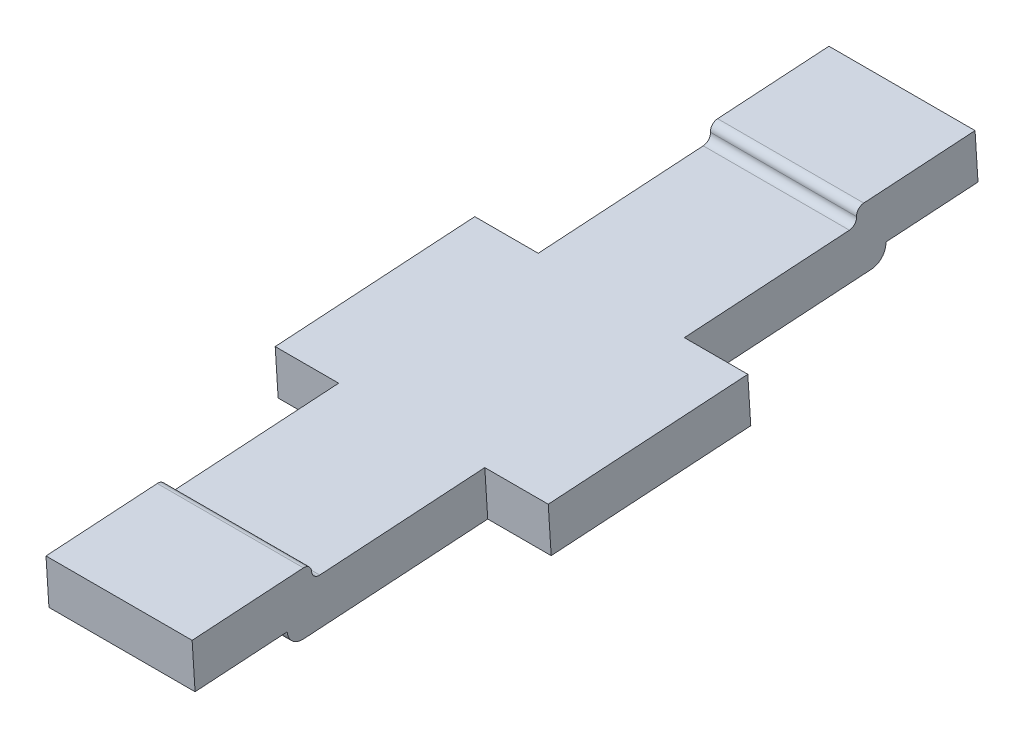
ISO-10303-21;
HEADER;
FILE_DESCRIPTION(('STEP AP214'),'2;1');
FILE_NAME('part.step','',(''),(''),'','','');
FILE_SCHEMA(('AUTOMOTIVE_DESIGN { 1 0 10303 214 1 1 1 1 }'));
ENDSEC;
DATA;
#1=APPLICATION_CONTEXT('core data for automotive mechanical design processes');
#2=APPLICATION_PROTOCOL_DEFINITION('international standard','automotive_design',2000,#1);
#3=PRODUCT_CONTEXT('',#1,'mechanical');
#4=PRODUCT('Part','Part','',(#3));
#5=PRODUCT_RELATED_PRODUCT_CATEGORY('part','',(#4));
#6=PRODUCT_DEFINITION_FORMATION('','',#4);
#7=PRODUCT_DEFINITION_CONTEXT('part definition',#1,'design');
#8=PRODUCT_DEFINITION('design','',#6,#7);
#9=PRODUCT_DEFINITION_SHAPE('','',#8);
#10=(LENGTH_UNIT() NAMED_UNIT(*) SI_UNIT(.MILLI.,.METRE.));
#11=(NAMED_UNIT(*) PLANE_ANGLE_UNIT() SI_UNIT($,.RADIAN.));
#12=(NAMED_UNIT(*) SI_UNIT($,.STERADIAN.) SOLID_ANGLE_UNIT());
#13=UNCERTAINTY_MEASURE_WITH_UNIT(LENGTH_MEASURE(1.E-05),#10,'distance_accuracy_value','');
#14=(GEOMETRIC_REPRESENTATION_CONTEXT(3) GLOBAL_UNCERTAINTY_ASSIGNED_CONTEXT((#13)) GLOBAL_UNIT_ASSIGNED_CONTEXT((#10,
#11,#12)) REPRESENTATION_CONTEXT('',''));
#15=CARTESIAN_POINT('',(0.,0.,0.));
#16=DIRECTION('',(0.,0.,1.));
#17=DIRECTION('',(1.,0.,0.));
#18=AXIS2_PLACEMENT_3D('',#15,#16,#17);
#19=CARTESIAN_POINT('',(-1.775,0.,0.));
#20=DIRECTION('',(1.,0.,0.));
#21=DIRECTION('',(0.,0.,-1.));
#22=AXIS2_PLACEMENT_3D('',#19,#20,#21);
#23=PLANE('',#22);
#24=DIRECTION('',(0.,0.997969082863627,0.0637001542253368));
#25=VECTOR('',#24,1.);
#26=CARTESIAN_POINT('',(-1.775,-0.707019964007326,1.25751663132818));
#27=LINE('',#26,#25);
#28=CARTESIAN_POINT('',(-1.775,-0.707019964007326,1.25751663132818));
#29=VERTEX_POINT('',#28);
#30=CARTESIAN_POINT('',(-1.775,-0.108238514289151,1.29573672386338));
#31=VERTEX_POINT('',#30);
#32=EDGE_CURVE('E11',#29,#31,#27,.T.);
#33=ORIENTED_EDGE('',*,*,#32,.T.);
#34=DIRECTION('',(0.,-0.0637001542253372,0.997969082863627));
#35=VECTOR('',#34,1.);
#36=CARTESIAN_POINT('',(-1.775,0.057381886696726,-1.29898289158205));
#37=LINE('',#36,#35);
#38=CARTESIAN_POINT('',(-1.775,0.057381886696726,-1.29898289158205));
#39=VERTEX_POINT('',#38);
#40=EDGE_CURVE('E41',#39,#31,#37,.T.);
#41=ORIENTED_EDGE('',*,*,#40,.F.);
#42=DIRECTION('',(0.,-0.997969082863627,-0.0637001542253365));
#43=VECTOR('',#42,1.);
#44=CARTESIAN_POINT('',(-1.775,0.057381886696726,-1.29898289158205));
#45=LINE('',#44,#43);
#46=CARTESIAN_POINT('',(-1.775,-0.54139956302145,-1.33720298411725));
#47=VERTEX_POINT('',#46);
#48=EDGE_CURVE('E27',#39,#47,#45,.T.);
#49=ORIENTED_EDGE('',*,*,#48,.T.);
#50=DIRECTION('',(0.,0.0637001542253371,-0.997969082863627));
#51=VECTOR('',#50,1.);
#52=CARTESIAN_POINT('',(-1.775,-0.707019964007326,1.25751663132818));
#53=LINE('',#52,#51);
#54=EDGE_CURVE('E261',#29,#47,#53,.T.);
#55=ORIENTED_EDGE('',*,*,#54,.F.);
#56=EDGE_LOOP('',(#33,#41,#49,#55));
#57=FACE_BOUND('',#56,.T.);
#58=ADVANCED_FACE('F16',(#57),#23,.F.);
#59=CARTESIAN_POINT('',(1.775,0.,0.));
#60=DIRECTION('',(1.,0.,0.));
#61=DIRECTION('',(0.,0.,-1.));
#62=AXIS2_PLACEMENT_3D('',#59,#60,#61);
#63=PLANE('',#62);
#64=DIRECTION('',(0.,-0.997969082863627,-0.0637001542253372));
#65=VECTOR('',#64,1.);
#66=CARTESIAN_POINT('',(1.775,-0.707019964007326,1.25751663132818));
#67=LINE('',#66,#65);
#68=CARTESIAN_POINT('',(1.775,-0.108238514289151,1.29573672386338));
#69=VERTEX_POINT('',#68);
#70=CARTESIAN_POINT('',(1.775,-0.707019964007326,1.25751663132818));
#71=VERTEX_POINT('',#70);
#72=EDGE_CURVE('E304',#69,#71,#67,.T.);
#73=ORIENTED_EDGE('',*,*,#72,.T.);
#74=DIRECTION('',(0.,0.0637001542253371,-0.997969082863627));
#75=VECTOR('',#74,1.);
#76=CARTESIAN_POINT('',(1.775,-0.707019964007326,1.25751663132818));
#77=LINE('',#76,#75);
#78=CARTESIAN_POINT('',(1.775,-0.54139956302145,-1.33720298411725));
#79=VERTEX_POINT('',#78);
#80=EDGE_CURVE('E308',#71,#79,#77,.T.);
#81=ORIENTED_EDGE('',*,*,#80,.T.);
#82=DIRECTION('',(0.,0.997969082863627,0.0637001542253368));
#83=VECTOR('',#82,1.);
#84=CARTESIAN_POINT('',(1.775,0.0573818866967259,-1.29898289158205));
#85=LINE('',#84,#83);
#86=CARTESIAN_POINT('',(1.775,0.0573818866967259,-1.29898289158205));
#87=VERTEX_POINT('',#86);
#88=EDGE_CURVE('E363',#79,#87,#85,.T.);
#89=ORIENTED_EDGE('',*,*,#88,.T.);
#90=DIRECTION('',(0.,-0.0637001542253372,0.997969082863627));
#91=VECTOR('',#90,1.);
#92=CARTESIAN_POINT('',(1.775,0.0573818866967259,-1.29898289158205));
#93=LINE('',#92,#91);
#94=EDGE_CURVE('E317',#87,#69,#93,.T.);
#95=ORIENTED_EDGE('',*,*,#94,.T.);
#96=EDGE_LOOP('',(#73,#81,#89,#95));
#97=FACE_BOUND('',#96,.T.);
#98=ADVANCED_FACE('F502',(#97),#63,.T.);
#99=CARTESIAN_POINT('',(-1.775,-0.749486733490884,5.06253917705503));
#100=DIRECTION('',(0.,-0.997969082863627,-0.0637001542253375));
#101=DIRECTION('',(0.,0.0637001542253375,-0.997969082863627));
#102=AXIS2_PLACEMENT_3D('',#99,#100,#101);
#103=PLANE('',#102);
#104=DIRECTION('',(0.,-0.0637001542253376,0.997969082863627));
#105=VECTOR('',#104,1.);
#106=CARTESIAN_POINT('',(0.95,-0.749486733490884,5.06253917705503));
#107=LINE('',#106,#105);
#108=CARTESIAN_POINT('',(0.95,-0.673046548420478,3.86497627761868));
#109=VERTEX_POINT('',#108);
#110=CARTESIAN_POINT('',(0.95,-0.749486733490884,5.06253917705503));
#111=VERTEX_POINT('',#110);
#112=EDGE_CURVE('E313',#109,#111,#107,.T.);
#113=ORIENTED_EDGE('',*,*,#112,.T.);
#114=DIRECTION('',(1.,0.,0.));
#115=VECTOR('',#114,1.);
#116=CARTESIAN_POINT('',(-0.95,-0.749486733490884,5.06253917705503));
#117=LINE('',#116,#115);
#118=CARTESIAN_POINT('',(-0.95,-0.749486733490884,5.06253917705503));
#119=VERTEX_POINT('',#118);
#120=EDGE_CURVE('E319',#119,#111,#117,.T.);
#121=ORIENTED_EDGE('',*,*,#120,.F.);
#122=DIRECTION('',(0.,0.0637001542253376,-0.997969082863627));
#123=VECTOR('',#122,1.);
#124=CARTESIAN_POINT('',(-0.95,-0.673046548420479,3.86497627761868));
#125=LINE('',#124,#123);
#126=CARTESIAN_POINT('',(-0.95,-0.673046548420478,3.86497627761868));
#127=VERTEX_POINT('',#126);
#128=EDGE_CURVE('E318',#119,#127,#125,.T.);
#129=ORIENTED_EDGE('',*,*,#128,.T.);
#130=DIRECTION('',(1.,0.,0.));
#131=VECTOR('',#130,1.);
#132=CARTESIAN_POINT('',(-0.95,-0.673046548420479,3.86497627761868));
#133=LINE('',#132,#131);
#134=EDGE_CURVE('E355',#127,#109,#133,.T.);
#135=ORIENTED_EDGE('',*,*,#134,.T.);
#136=EDGE_LOOP('',(#113,#121,#129,#135));
#137=FACE_BOUND('',#136,.T.);
#138=ADVANCED_FACE('F519',(#137),#103,.T.);
#139=CARTESIAN_POINT('',(-1.775,-0.150705283772707,5.10075926959023));
#140=DIRECTION('',(0.,-0.0637001542253374,0.997969082863627));
#141=DIRECTION('',(-1.,0.,0.));
#142=AXIS2_PLACEMENT_3D('',#139,#140,#141);
#143=PLANE('',#142);
#144=DIRECTION('',(0.,0.997969082863627,0.0637001542253374));
#145=VECTOR('',#144,1.);
#146=CARTESIAN_POINT('',(0.95,-0.150705283772707,5.10075926959023));
#147=LINE('',#146,#145);
#148=CARTESIAN_POINT('',(0.95,-0.150705283772707,5.10075926959023));
#149=VERTEX_POINT('',#148);
#150=EDGE_CURVE('E385',#111,#149,#147,.T.);
#151=ORIENTED_EDGE('',*,*,#150,.T.);
#152=DIRECTION('',(1.,0.,0.));
#153=VECTOR('',#152,1.);
#154=CARTESIAN_POINT('',(-0.95,-0.150705283772707,5.10075926959023));
#155=LINE('',#154,#153);
#156=CARTESIAN_POINT('',(-0.95,-0.150705283772707,5.10075926959023));
#157=VERTEX_POINT('',#156);
#158=EDGE_CURVE('E202',#157,#149,#155,.T.);
#159=ORIENTED_EDGE('',*,*,#158,.F.);
#160=DIRECTION('',(0.,-0.997969082863627,-0.0637001542253374));
#161=VECTOR('',#160,1.);
#162=CARTESIAN_POINT('',(-0.95,-0.749486733490884,5.06253917705503));
#163=LINE('',#162,#161);
#164=EDGE_CURVE('E322',#157,#119,#163,.T.);
#165=ORIENTED_EDGE('',*,*,#164,.T.);
#166=ORIENTED_EDGE('',*,*,#120,.T.);
#167=EDGE_LOOP('',(#151,#159,#165,#166));
#168=FACE_BOUND('',#167,.T.);
#169=ADVANCED_FACE('F517',(#168),#143,.T.);
#170=CARTESIAN_POINT('',(-1.775,-0.0583400601459682,3.65370409943797));
#171=DIRECTION('',(0.,0.997969082863627,0.0637001542253369));
#172=DIRECTION('',(1.,0.,0.));
#173=AXIS2_PLACEMENT_3D('',#170,#171,#172);
#174=PLANE('',#173);
#175=DIRECTION('',(0.,0.0637001542253369,-0.997969082863627));
#176=VECTOR('',#175,1.);
#177=CARTESIAN_POINT('',(0.95,-0.0583400601459682,3.65370409943797));
#178=LINE('',#177,#176);
#179=CARTESIAN_POINT('',(0.95,-0.0583400601459681,3.65370409943797));
#180=VERTEX_POINT('',#179);
#181=EDGE_CURVE('E323',#149,#180,#178,.T.);
#182=ORIENTED_EDGE('',*,*,#181,.T.);
#183=DIRECTION('',(1.,0.,0.));
#184=VECTOR('',#183,1.);
#185=CARTESIAN_POINT('',(-0.95,-0.0583400601459682,3.65370409943797));
#186=LINE('',#185,#184);
#187=CARTESIAN_POINT('',(-0.95,-0.0583400601459681,3.65370409943797));
#188=VERTEX_POINT('',#187);
#189=EDGE_CURVE('E218',#188,#180,#186,.T.);
#190=ORIENTED_EDGE('',*,*,#189,.F.);
#191=DIRECTION('',(0.,-0.0637001542253369,0.997969082863627));
#192=VECTOR('',#191,1.);
#193=CARTESIAN_POINT('',(-0.95,-0.150705283772707,5.10075926959023));
#194=LINE('',#193,#192);
#195=EDGE_CURVE('E336',#188,#157,#194,.T.);
#196=ORIENTED_EDGE('',*,*,#195,.T.);
#197=ORIENTED_EDGE('',*,*,#158,.T.);
#198=EDGE_LOOP('',(#182,#190,#196,#197));
#199=FACE_BOUND('',#198,.T.);
#200=ADVANCED_FACE('F522',(#199),#174,.T.);
#201=CARTESIAN_POINT('',(-1.775,-0.158136968432331,3.64733408401544));
#202=DIRECTION('',(1.,0.,0.));
#203=DIRECTION('',(0.,0.0637001542253356,-0.997969082863627));
#204=AXIS2_PLACEMENT_3D('',#201,#202,#203);
#205=CYLINDRICAL_SURFACE('',#204,0.1);
#206=CARTESIAN_POINT('',(0.95,-0.158136968432331,3.64733408401544));
#207=DIRECTION('',(-1.,0.,0.));
#208=DIRECTION('',(0.,0.0637001542253355,-0.997969082863627));
#209=AXIS2_PLACEMENT_3D('',#206,#207,#208);
#210=CIRCLE('',#209,0.1);
#211=CARTESIAN_POINT('',(0.95,-0.151766953009797,3.54753717572908));
#212=VERTEX_POINT('',#211);
#213=EDGE_CURVE('E337',#180,#212,#210,.T.);
#214=ORIENTED_EDGE('',*,*,#213,.T.);
#215=DIRECTION('',(1.,0.,0.));
#216=VECTOR('',#215,1.);
#217=CARTESIAN_POINT('',(-0.95,-0.151766953009797,3.54753717572908));
#218=LINE('',#217,#216);
#219=CARTESIAN_POINT('',(-0.95,-0.151766953009797,3.54753717572908));
#220=VERTEX_POINT('',#219);
#221=EDGE_CURVE('E398',#220,#212,#218,.T.);
#222=ORIENTED_EDGE('',*,*,#221,.F.);
#223=CARTESIAN_POINT('',(-0.95,-0.158136968432331,3.64733408401544));
#224=DIRECTION('',(1.,0.,0.));
#225=DIRECTION('',(0.,0.0637001542253355,-0.997969082863627));
#226=AXIS2_PLACEMENT_3D('',#223,#224,#225);
#227=CIRCLE('',#226,0.1);
#228=EDGE_CURVE('E389',#220,#188,#227,.T.);
#229=ORIENTED_EDGE('',*,*,#228,.T.);
#230=ORIENTED_EDGE('',*,*,#189,.T.);
#231=EDGE_LOOP('',(#214,#222,#229,#230));
#232=FACE_BOUND('',#231,.T.);
#233=ADVANCED_FACE('F524',(#232),#205,.T.);
#234=CARTESIAN_POINT('',(-1.775,-0.145396937587263,3.44774026744271));
#235=DIRECTION('',(-1.,0.,0.));
#236=DIRECTION('',(0.,-0.997969082863627,-0.0637001542253391));
#237=AXIS2_PLACEMENT_3D('',#234,#235,#236);
#238=CYLINDRICAL_SURFACE('',#237,0.1);
#239=CARTESIAN_POINT('',(0.95,-0.145396937587263,3.44774026744271));
#240=DIRECTION('',(1.,0.,0.));
#241=DIRECTION('',(0.,-0.997969082863627,-0.063700154225339));
#242=AXIS2_PLACEMENT_3D('',#239,#240,#241);
#243=CIRCLE('',#242,0.1);
#244=CARTESIAN_POINT('',(0.95,-0.245193845873626,3.44137025202018));
#245=VERTEX_POINT('',#244);
#246=EDGE_CURVE('E298',#212,#245,#243,.T.);
#247=ORIENTED_EDGE('',*,*,#246,.T.);
#248=DIRECTION('',(1.,0.,0.));
#249=VECTOR('',#248,1.);
#250=CARTESIAN_POINT('',(-0.95,-0.245193845873626,3.44137025202018));
#251=LINE('',#250,#249);
#252=CARTESIAN_POINT('',(-0.95,-0.245193845873626,3.44137025202018));
#253=VERTEX_POINT('',#252);
#254=EDGE_CURVE('E324',#253,#245,#251,.T.);
#255=ORIENTED_EDGE('',*,*,#254,.F.);
#256=CARTESIAN_POINT('',(-0.95,-0.145396937587263,3.44774026744271));
#257=DIRECTION('',(-1.,0.,0.));
#258=DIRECTION('',(0.,-0.997969082863627,-0.063700154225339));
#259=AXIS2_PLACEMENT_3D('',#256,#257,#258);
#260=CIRCLE('',#259,0.1);
#261=EDGE_CURVE('E401',#253,#220,#260,.T.);
#262=ORIENTED_EDGE('',*,*,#261,.T.);
#263=ORIENTED_EDGE('',*,*,#221,.T.);
#264=EDGE_LOOP('',(#247,#255,#262,#263));
#265=FACE_BOUND('',#264,.T.);
#266=ADVANCED_FACE('F527',(#265),#238,.F.);
#267=CARTESIAN_POINT('',(-1.775,0.194337218281201,-3.44461641973884));
#268=DIRECTION('',(0.,0.997969082863627,0.0637001542253372));
#269=DIRECTION('',(1.,0.,0.));
#270=AXIS2_PLACEMENT_3D('',#267,#268,#269);
#271=PLANE('',#270);
#272=DIRECTION('',(1.,0.,0.));
#273=VECTOR('',#272,1.);
#274=CARTESIAN_POINT('',(1.775,-0.108238514289151,1.29573672386338));
#275=LINE('',#274,#273);
#276=CARTESIAN_POINT('',(0.95,-0.108238514289151,1.29573672386338));
#277=VERTEX_POINT('',#276);
#278=EDGE_CURVE('E378',#277,#69,#275,.T.);
#279=ORIENTED_EDGE('',*,*,#278,.T.);
#280=ORIENTED_EDGE('',*,*,#94,.F.);
#281=DIRECTION('',(-1.,0.,0.));
#282=VECTOR('',#281,1.);
#283=CARTESIAN_POINT('',(0.95,0.0573818866967259,-1.29898289158205));
#284=LINE('',#283,#282);
#285=CARTESIAN_POINT('',(0.95,0.0573818866967253,-1.29898289158205));
#286=VERTEX_POINT('',#285);
#287=EDGE_CURVE('E369',#87,#286,#284,.T.);
#288=ORIENTED_EDGE('',*,*,#287,.T.);
#289=DIRECTION('',(0.,0.0637001542253372,-0.997969082863627));
#290=VECTOR('',#289,1.);
#291=CARTESIAN_POINT('',(0.95,0.194337218281201,-3.44461641973884));
#292=LINE('',#291,#290);
#293=CARTESIAN_POINT('',(0.95,0.194337218281201,-3.44461641973884));
#294=VERTEX_POINT('',#293);
#295=EDGE_CURVE('E58',#286,#294,#292,.T.);
#296=ORIENTED_EDGE('',*,*,#295,.T.);
#297=DIRECTION('',(1.,0.,0.));
#298=VECTOR('',#297,1.);
#299=CARTESIAN_POINT('',(-0.95,0.194337218281201,-3.44461641973884));
#300=LINE('',#299,#298);
#301=CARTESIAN_POINT('',(-0.95,0.194337218281201,-3.44461641973884));
#302=VERTEX_POINT('',#301);
#303=EDGE_CURVE('E74',#302,#294,#300,.T.);
#304=ORIENTED_EDGE('',*,*,#303,.F.);
#305=DIRECTION('',(0.,-0.0637001542253372,0.997969082863627));
#306=VECTOR('',#305,1.);
#307=CARTESIAN_POINT('',(-0.95,0.0573818866967259,-1.29898289158205));
#308=LINE('',#307,#306);
#309=CARTESIAN_POINT('',(-0.95,0.0573818866967262,-1.29898289158205));
#310=VERTEX_POINT('',#309);
#311=EDGE_CURVE('E370',#302,#310,#308,.T.);
#312=ORIENTED_EDGE('',*,*,#311,.T.);
#313=DIRECTION('',(-1.,0.,0.));
#314=VECTOR('',#313,1.);
#315=CARTESIAN_POINT('',(-1.775,0.057381886696726,-1.29898289158205));
#316=LINE('',#315,#314);
#317=EDGE_CURVE('E394',#310,#39,#316,.T.);
#318=ORIENTED_EDGE('',*,*,#317,.T.);
#319=ORIENTED_EDGE('',*,*,#40,.T.);
#320=DIRECTION('',(1.,0.,0.));
#321=VECTOR('',#320,1.);
#322=CARTESIAN_POINT('',(-0.95,-0.108238514289151,1.29573672386338));
#323=LINE('',#322,#321);
#324=CARTESIAN_POINT('',(-0.95,-0.108238514289151,1.29573672386338));
#325=VERTEX_POINT('',#324);
#326=EDGE_CURVE('E342',#31,#325,#323,.T.);
#327=ORIENTED_EDGE('',*,*,#326,.T.);
#328=DIRECTION('',(0.,-0.0637001542253371,0.997969082863627));
#329=VECTOR('',#328,1.);
#330=CARTESIAN_POINT('',(-0.95,-0.245193845873626,3.44137025202018));
#331=LINE('',#330,#329);
#332=EDGE_CURVE('E277',#325,#253,#331,.T.);
#333=ORIENTED_EDGE('',*,*,#332,.T.);
#334=ORIENTED_EDGE('',*,*,#254,.T.);
#335=DIRECTION('',(0.,0.0637001542253371,-0.997969082863627));
#336=VECTOR('',#335,1.);
#337=CARTESIAN_POINT('',(0.95,-0.108238514289151,1.29573672386338));
#338=LINE('',#337,#336);
#339=EDGE_CURVE('E327',#245,#277,#338,.T.);
#340=ORIENTED_EDGE('',*,*,#339,.T.);
#341=EDGE_LOOP('',(#279,#280,#288,#296,#304,#312,#318,#319,#327,#333,#334,#340));
#342=FACE_BOUND('',#341,.T.);
#343=ADVANCED_FACE('F528',(#342),#271,.T.);
#344=CARTESIAN_POINT('',(-1.775,0.294134126567563,-3.43824640431631));
#345=DIRECTION('',(-1.,0.,0.));
#346=DIRECTION('',(0.,0.0637001542253392,-0.997969082863627));
#347=AXIS2_PLACEMENT_3D('',#344,#345,#346);
#348=CYLINDRICAL_SURFACE('',#347,0.1);
#349=CARTESIAN_POINT('',(0.95,0.294134126567564,-3.43824640431631));
#350=DIRECTION('',(1.,0.,0.));
#351=DIRECTION('',(0.,0.0637001542253391,-0.997969082863627));
#352=AXIS2_PLACEMENT_3D('',#349,#350,#351);
#353=CIRCLE('',#352,0.1);
#354=CARTESIAN_POINT('',(0.95,0.300504141990097,-3.53804331260267));
#355=VERTEX_POINT('',#354);
#356=EDGE_CURVE('E312',#294,#355,#353,.T.);
#357=ORIENTED_EDGE('',*,*,#356,.T.);
#358=DIRECTION('',(1.,0.,0.));
#359=VECTOR('',#358,1.);
#360=CARTESIAN_POINT('',(-0.95,0.300504141990097,-3.53804331260267));
#361=LINE('',#360,#359);
#362=CARTESIAN_POINT('',(-0.95,0.300504141990097,-3.53804331260267));
#363=VERTEX_POINT('',#362);
#364=EDGE_CURVE('E299',#363,#355,#361,.T.);
#365=ORIENTED_EDGE('',*,*,#364,.F.);
#366=CARTESIAN_POINT('',(-0.95,0.294134126567564,-3.43824640431631));
#367=DIRECTION('',(-1.,0.,0.));
#368=DIRECTION('',(0.,0.0637001542253391,-0.997969082863627));
#369=AXIS2_PLACEMENT_3D('',#366,#367,#368);
#370=CIRCLE('',#369,0.1);
#371=EDGE_CURVE('E309',#363,#302,#370,.T.);
#372=ORIENTED_EDGE('',*,*,#371,.T.);
#373=ORIENTED_EDGE('',*,*,#303,.T.);
#374=EDGE_LOOP('',(#357,#365,#372,#373));
#375=FACE_BOUND('',#374,.T.);
#376=ADVANCED_FACE('F783',(#375),#348,.F.);
#377=CARTESIAN_POINT('',(-1.775,0.306874157412631,-3.63784022088904));
#378=DIRECTION('',(1.,0.,0.));
#379=DIRECTION('',(0.,0.997969082863627,0.0637001542253391));
#380=AXIS2_PLACEMENT_3D('',#377,#378,#379);
#381=CYLINDRICAL_SURFACE('',#380,0.1);
#382=CARTESIAN_POINT('',(0.95,0.306874157412631,-3.63784022088904));
#383=DIRECTION('',(-1.,0.,0.));
#384=DIRECTION('',(0.,0.997969082863627,0.063700154225339));
#385=AXIS2_PLACEMENT_3D('',#382,#383,#384);
#386=CIRCLE('',#385,0.1);
#387=CARTESIAN_POINT('',(0.95,0.406671065698993,-3.6314702054665));
#388=VERTEX_POINT('',#387);
#389=EDGE_CURVE('E375',#355,#388,#386,.T.);
#390=ORIENTED_EDGE('',*,*,#389,.T.);
#391=DIRECTION('',(1.,0.,0.));
#392=VECTOR('',#391,1.);
#393=CARTESIAN_POINT('',(-0.95,0.406671065698993,-3.6314702054665));
#394=LINE('',#393,#392);
#395=CARTESIAN_POINT('',(-0.95,0.406671065698993,-3.6314702054665));
#396=VERTEX_POINT('',#395);
#397=EDGE_CURVE('E430',#396,#388,#394,.T.);
#398=ORIENTED_EDGE('',*,*,#397,.F.);
#399=CARTESIAN_POINT('',(-0.95,0.306874157412631,-3.63784022088904));
#400=DIRECTION('',(1.,0.,0.));
#401=DIRECTION('',(0.,0.997969082863627,0.063700154225339));
#402=AXIS2_PLACEMENT_3D('',#399,#400,#401);
#403=CIRCLE('',#402,0.1);
#404=EDGE_CURVE('E302',#396,#363,#403,.T.);
#405=ORIENTED_EDGE('',*,*,#404,.T.);
#406=ORIENTED_EDGE('',*,*,#364,.T.);
#407=EDGE_LOOP('',(#390,#398,#405,#406));
#408=FACE_BOUND('',#407,.T.);
#409=ADVANCED_FACE('F740',(#408),#381,.T.);
#410=CARTESIAN_POINT('',(-1.775,0.499036289325733,-5.07852537561876));
#411=DIRECTION('',(0.,0.997969082863627,0.0637001542253375));
#412=DIRECTION('',(1.,0.,0.));
#413=AXIS2_PLACEMENT_3D('',#410,#411,#412);
#414=PLANE('',#413);
#415=DIRECTION('',(0.,0.0637001542253375,-0.997969082863627));
#416=VECTOR('',#415,1.);
#417=CARTESIAN_POINT('',(0.95,0.499036289325733,-5.07852537561876));
#418=LINE('',#417,#416);
#419=CARTESIAN_POINT('',(0.95,0.499036289325733,-5.07852537561876));
#420=VERTEX_POINT('',#419);
#421=EDGE_CURVE('E303',#388,#420,#418,.T.);
#422=ORIENTED_EDGE('',*,*,#421,.T.);
#423=DIRECTION('',(1.,0.,0.));
#424=VECTOR('',#423,1.);
#425=CARTESIAN_POINT('',(-0.95,0.499036289325733,-5.07852537561876));
#426=LINE('',#425,#424);
#427=CARTESIAN_POINT('',(-0.95,0.499036289325733,-5.07852537561876));
#428=VERTEX_POINT('',#427);
#429=EDGE_CURVE('E333',#428,#420,#426,.T.);
#430=ORIENTED_EDGE('',*,*,#429,.F.);
#431=DIRECTION('',(0.,-0.0637001542253375,0.997969082863627));
#432=VECTOR('',#431,1.);
#433=CARTESIAN_POINT('',(-0.95,0.406671065698993,-3.6314702054665));
#434=LINE('',#433,#432);
#435=EDGE_CURVE('E418',#428,#396,#434,.T.);
#436=ORIENTED_EDGE('',*,*,#435,.T.);
#437=ORIENTED_EDGE('',*,*,#397,.T.);
#438=EDGE_LOOP('',(#422,#430,#436,#437));
#439=FACE_BOUND('',#438,.T.);
#440=ADVANCED_FACE('F484',(#439),#414,.T.);
#441=CARTESIAN_POINT('',(-1.775,-0.099745160392445,-5.11674546815396));
#442=DIRECTION('',(0.,0.0637001542253403,-0.997969082863627));
#443=DIRECTION('',(-1.,0.,0.));
#444=AXIS2_PLACEMENT_3D('',#441,#442,#443);
#445=PLANE('',#444);
#446=DIRECTION('',(0.,-0.997969082863627,-0.0637001542253406));
#447=VECTOR('',#446,1.);
#448=CARTESIAN_POINT('',(0.95,-0.099745160392445,-5.11674546815396));
#449=LINE('',#448,#447);
#450=CARTESIAN_POINT('',(0.95,-0.099745160392445,-5.11674546815397));
#451=VERTEX_POINT('',#450);
#452=EDGE_CURVE('E332',#420,#451,#449,.T.);
#453=ORIENTED_EDGE('',*,*,#452,.T.);
#454=DIRECTION('',(1.,0.,0.));
#455=VECTOR('',#454,1.);
#456=CARTESIAN_POINT('',(-0.95,-0.099745160392445,-5.11674546815396));
#457=LINE('',#456,#455);
#458=CARTESIAN_POINT('',(-0.95,-0.099745160392445,-5.11674546815396));
#459=VERTEX_POINT('',#458);
#460=EDGE_CURVE('E397',#459,#451,#457,.T.);
#461=ORIENTED_EDGE('',*,*,#460,.F.);
#462=DIRECTION('',(0.,0.997969082863627,0.0637001542253407));
#463=VECTOR('',#462,1.);
#464=CARTESIAN_POINT('',(-0.95,0.499036289325729,-5.07852537561876));
#465=LINE('',#464,#463);
#466=EDGE_CURVE('E328',#459,#428,#465,.T.);
#467=ORIENTED_EDGE('',*,*,#466,.T.);
#468=ORIENTED_EDGE('',*,*,#429,.T.);
#469=EDGE_LOOP('',(#453,#461,#467,#468));
#470=FACE_BOUND('',#469,.T.);
#471=ADVANCED_FACE('F18',(#470),#445,.T.);
#472=CARTESIAN_POINT('',(-1.775,-0.176185345462849,-3.91918256871761));
#473=DIRECTION('',(0.,-0.997969082863627,-0.063700154225337));
#474=DIRECTION('',(0.,0.063700154225337,-0.997969082863627));
#475=AXIS2_PLACEMENT_3D('',#472,#473,#474);
#476=PLANE('',#475);
#477=DIRECTION('',(0.,-0.0637001542253369,0.997969082863627));
#478=VECTOR('',#477,1.);
#479=CARTESIAN_POINT('',(0.95,-0.176185345462849,-3.91918256871761));
#480=LINE('',#479,#478);
#481=CARTESIAN_POINT('',(0.95,-0.176185345462849,-3.91918256871761));
#482=VERTEX_POINT('',#481);
#483=EDGE_CURVE('E440',#451,#482,#480,.T.);
#484=ORIENTED_EDGE('',*,*,#483,.T.);
#485=DIRECTION('',(1.,0.,0.));
#486=VECTOR('',#485,1.);
#487=CARTESIAN_POINT('',(-0.95,-0.176185345462849,-3.91918256871761));
#488=LINE('',#487,#486);
#489=CARTESIAN_POINT('',(-0.95,-0.176185345462849,-3.91918256871761));
#490=VERTEX_POINT('',#489);
#491=EDGE_CURVE('E89',#490,#482,#488,.T.);
#492=ORIENTED_EDGE('',*,*,#491,.F.);
#493=DIRECTION('',(0.,0.063700154225337,-0.997969082863627));
#494=VECTOR('',#493,1.);
#495=CARTESIAN_POINT('',(-0.95,-0.099745160392445,-5.11674546815396));
#496=LINE('',#495,#494);
#497=EDGE_CURVE('E409',#490,#459,#496,.T.);
#498=ORIENTED_EDGE('',*,*,#497,.T.);
#499=ORIENTED_EDGE('',*,*,#460,.T.);
#500=EDGE_LOOP('',(#484,#492,#498,#499));
#501=FACE_BOUND('',#500,.T.);
#502=ADVANCED_FACE('F493',(#501),#476,.T.);
#503=CARTESIAN_POINT('',(-1.775,-0.188925376307915,-3.71958875214489));
#504=DIRECTION('',(1.,0.,0.));
#505=DIRECTION('',(0.,-0.997969082863627,-0.0637001542253369));
#506=AXIS2_PLACEMENT_3D('',#503,#504,#505);
#507=CYLINDRICAL_SURFACE('',#506,0.2);
#508=CARTESIAN_POINT('',(0.95,-0.188925376307915,-3.71958875214489));
#509=DIRECTION('',(-1.,0.,0.));
#510=DIRECTION('',(0.,-0.997969082863627,-0.0637001542253368));
#511=AXIS2_PLACEMENT_3D('',#508,#509,#510);
#512=CIRCLE('',#511,0.2);
#513=CARTESIAN_POINT('',(0.95,-0.388519192880641,-3.73232878298995));
#514=VERTEX_POINT('',#513);
#515=EDGE_CURVE('E351',#482,#514,#512,.T.);
#516=ORIENTED_EDGE('',*,*,#515,.T.);
#517=DIRECTION('',(1.,0.,0.));
#518=VECTOR('',#517,1.);
#519=CARTESIAN_POINT('',(-0.95,-0.388519192880641,-3.73232878298995));
#520=LINE('',#519,#518);
#521=CARTESIAN_POINT('',(-0.95,-0.388519192880641,-3.73232878298995));
#522=VERTEX_POINT('',#521);
#523=EDGE_CURVE('E101',#522,#514,#520,.T.);
#524=ORIENTED_EDGE('',*,*,#523,.F.);
#525=CARTESIAN_POINT('',(-0.95,-0.188925376307915,-3.71958875214489));
#526=DIRECTION('',(1.,0.,0.));
#527=DIRECTION('',(0.,-0.997969082863627,-0.0637001542253368));
#528=AXIS2_PLACEMENT_3D('',#525,#526,#527);
#529=CIRCLE('',#528,0.2);
#530=EDGE_CURVE('E347',#522,#490,#529,.T.);
#531=ORIENTED_EDGE('',*,*,#530,.T.);
#532=ORIENTED_EDGE('',*,*,#491,.T.);
#533=EDGE_LOOP('',(#516,#524,#531,#532));
#534=FACE_BOUND('',#533,.T.);
#535=ADVANCED_FACE('F495',(#534),#507,.T.);
#536=CARTESIAN_POINT('',(-1.775,-0.859900334148136,3.65264243020089));
#537=DIRECTION('',(0.,-0.997969082863627,-0.0637001542253371));
#538=DIRECTION('',(0.,0.0637001542253371,-0.997969082863627));
#539=AXIS2_PLACEMENT_3D('',#536,#537,#538);
#540=PLANE('',#539);
#541=DIRECTION('',(-1.,0.,0.));
#542=VECTOR('',#541,1.);
#543=CARTESIAN_POINT('',(0.95,-0.707019964007326,1.25751663132818));
#544=LINE('',#543,#542);
#545=CARTESIAN_POINT('',(0.95,-0.707019964007326,1.25751663132818));
#546=VERTEX_POINT('',#545);
#547=EDGE_CURVE('E348',#71,#546,#544,.T.);
#548=ORIENTED_EDGE('',*,*,#547,.T.);
#549=DIRECTION('',(0.,-0.0637001542253372,0.997969082863627));
#550=VECTOR('',#549,1.);
#551=CARTESIAN_POINT('',(0.95,-0.859900334148136,3.65264243020089));
#552=LINE('',#551,#550);
#553=CARTESIAN_POINT('',(0.95,-0.859900334148136,3.65264243020089));
#554=VERTEX_POINT('',#553);
#555=EDGE_CURVE('E272',#546,#554,#552,.T.);
#556=ORIENTED_EDGE('',*,*,#555,.T.);
#557=DIRECTION('',(1.,0.,0.));
#558=VECTOR('',#557,1.);
#559=CARTESIAN_POINT('',(-0.95,-0.859900334148136,3.65264243020089));
#560=LINE('',#559,#558);
#561=CARTESIAN_POINT('',(-0.95,-0.859900334148136,3.65264243020089));
#562=VERTEX_POINT('',#561);
#563=EDGE_CURVE('E267',#562,#554,#560,.T.);
#564=ORIENTED_EDGE('',*,*,#563,.F.);
#565=DIRECTION('',(0.,0.0637001542253371,-0.997969082863627));
#566=VECTOR('',#565,1.);
#567=CARTESIAN_POINT('',(-0.95,-0.707019964007326,1.25751663132818));
#568=LINE('',#567,#566);
#569=CARTESIAN_POINT('',(-0.95,-0.707019964007327,1.25751663132818));
#570=VERTEX_POINT('',#569);
#571=EDGE_CURVE('E260',#562,#570,#568,.T.);
#572=ORIENTED_EDGE('',*,*,#571,.T.);
#573=DIRECTION('',(-1.,0.,0.));
#574=VECTOR('',#573,1.);
#575=CARTESIAN_POINT('',(-1.775,-0.707019964007326,1.25751663132818));
#576=LINE('',#575,#574);
#577=EDGE_CURVE('E254',#570,#29,#576,.T.);
#578=ORIENTED_EDGE('',*,*,#577,.T.);
#579=ORIENTED_EDGE('',*,*,#54,.T.);
#580=DIRECTION('',(1.,0.,0.));
#581=VECTOR('',#580,1.);
#582=CARTESIAN_POINT('',(-0.95,-0.54139956302145,-1.33720298411725));
#583=LINE('',#582,#581);
#584=CARTESIAN_POINT('',(-0.95,-0.54139956302145,-1.33720298411725));
#585=VERTEX_POINT('',#584);
#586=EDGE_CURVE('E360',#47,#585,#583,.T.);
#587=ORIENTED_EDGE('',*,*,#586,.T.);
#588=DIRECTION('',(0.,0.0637001542253372,-0.997969082863627));
#589=VECTOR('',#588,1.);
#590=CARTESIAN_POINT('',(-0.95,-0.388519192880641,-3.73232878298995));
#591=LINE('',#590,#589);
#592=EDGE_CURVE('E340',#585,#522,#591,.T.);
#593=ORIENTED_EDGE('',*,*,#592,.T.);
#594=ORIENTED_EDGE('',*,*,#523,.T.);
#595=DIRECTION('',(0.,-0.0637001542253371,0.997969082863627));
#596=VECTOR('',#595,1.);
#597=CARTESIAN_POINT('',(0.95,-0.54139956302145,-1.33720298411725));
#598=LINE('',#597,#596);
#599=CARTESIAN_POINT('',(0.95,-0.54139956302145,-1.33720298411725));
#600=VERTEX_POINT('',#599);
#601=EDGE_CURVE('E341',#514,#600,#598,.T.);
#602=ORIENTED_EDGE('',*,*,#601,.T.);
#603=DIRECTION('',(1.,0.,0.));
#604=VECTOR('',#603,1.);
#605=CARTESIAN_POINT('',(1.775,-0.54139956302145,-1.33720298411725));
#606=LINE('',#605,#604);
#607=EDGE_CURVE('E412',#600,#79,#606,.T.);
#608=ORIENTED_EDGE('',*,*,#607,.T.);
#609=ORIENTED_EDGE('',*,*,#80,.F.);
#610=EDGE_LOOP('',(#548,#556,#564,#572,#578,#579,#587,#593,#594,#602,#608,#609));
#611=FACE_BOUND('',#610,.T.);
#612=ADVANCED_FACE('F265',(#611),#540,.T.);
#613=CARTESIAN_POINT('',(-1.775,-0.66030651757541,3.66538246104595));
#614=DIRECTION('',(1.,0.,0.));
#615=DIRECTION('',(0.,-0.0637001542253351,0.997969082863627));
#616=AXIS2_PLACEMENT_3D('',#613,#614,#615);
#617=CYLINDRICAL_SURFACE('',#616,0.2);
#618=CARTESIAN_POINT('',(0.95,-0.66030651757541,3.66538246104595));
#619=DIRECTION('',(-1.,0.,0.));
#620=DIRECTION('',(0.,-0.0637001542253352,0.997969082863627));
#621=AXIS2_PLACEMENT_3D('',#618,#619,#620);
#622=CIRCLE('',#621,0.2);
#623=EDGE_CURVE('E419',#554,#109,#622,.T.);
#624=ORIENTED_EDGE('',*,*,#623,.T.);
#625=ORIENTED_EDGE('',*,*,#134,.F.);
#626=CARTESIAN_POINT('',(-0.95,-0.66030651757541,3.66538246104595));
#627=DIRECTION('',(1.,0.,0.));
#628=DIRECTION('',(0.,-0.0637001542253351,0.997969082863627));
#629=AXIS2_PLACEMENT_3D('',#626,#627,#628);
#630=CIRCLE('',#629,0.2);
#631=EDGE_CURVE('E423',#127,#562,#630,.T.);
#632=ORIENTED_EDGE('',*,*,#631,.T.);
#633=ORIENTED_EDGE('',*,*,#563,.T.);
#634=EDGE_LOOP('',(#624,#625,#632,#633));
#635=FACE_BOUND('',#634,.T.);
#636=ADVANCED_FACE('F513',(#635),#617,.T.);
#637=CARTESIAN_POINT('',(-0.95,-2.09725004933813,-1.43651258962682));
#638=DIRECTION('',(1.,0.,0.));
#639=DIRECTION('',(0.,0.,1.));
#640=AXIS2_PLACEMENT_3D('',#637,#638,#639);
#641=PLANE('',#640);
#642=ORIENTED_EDGE('',*,*,#592,.F.);
#643=DIRECTION('',(0.,0.997969082863627,0.0637001542253371));
#644=VECTOR('',#643,1.);
#645=CARTESIAN_POINT('',(-0.95,-0.54139956302145,-1.33720298411725));
#646=LINE('',#645,#644);
#647=EDGE_CURVE('E287',#585,#310,#646,.T.);
#648=ORIENTED_EDGE('',*,*,#647,.T.);
#649=ORIENTED_EDGE('',*,*,#311,.F.);
#650=ORIENTED_EDGE('',*,*,#371,.F.);
#651=ORIENTED_EDGE('',*,*,#404,.F.);
#652=ORIENTED_EDGE('',*,*,#435,.F.);
#653=ORIENTED_EDGE('',*,*,#466,.F.);
#654=ORIENTED_EDGE('',*,*,#497,.F.);
#655=ORIENTED_EDGE('',*,*,#530,.F.);
#656=EDGE_LOOP('',(#642,#648,#649,#650,#651,#652,#653,#654,#655));
#657=FACE_BOUND('',#656,.T.);
#658=ADVANCED_FACE('F488',(#657),#641,.F.);
#659=CARTESIAN_POINT('',(-1.775,-2.09725004933813,-1.43651258962682));
#660=DIRECTION('',(0.,-0.0637001542253368,0.997969082863627));
#661=DIRECTION('',(-1.,0.,0.));
#662=AXIS2_PLACEMENT_3D('',#659,#660,#661);
#663=PLANE('',#662);
#664=ORIENTED_EDGE('',*,*,#586,.F.);
#665=ORIENTED_EDGE('',*,*,#48,.F.);
#666=ORIENTED_EDGE('',*,*,#317,.F.);
#667=ORIENTED_EDGE('',*,*,#647,.F.);
#668=EDGE_LOOP('',(#664,#665,#666,#667));
#669=FACE_BOUND('',#668,.T.);
#670=ADVANCED_FACE('F728',(#669),#663,.F.);
#671=CARTESIAN_POINT('',(0.95,-2.09725004933813,-1.43651258962682));
#672=DIRECTION('',(0.,-0.063700154225337,0.997969082863627));
#673=DIRECTION('',(-1.,0.,0.));
#674=AXIS2_PLACEMENT_3D('',#671,#672,#673);
#675=PLANE('',#674);
#676=ORIENTED_EDGE('',*,*,#607,.F.);
#677=DIRECTION('',(0.,0.997969082863627,0.0637001542253369));
#678=VECTOR('',#677,1.);
#679=CARTESIAN_POINT('',(0.95,-0.54139956302145,-1.33720298411725));
#680=LINE('',#679,#678);
#681=EDGE_CURVE('E279',#600,#286,#680,.T.);
#682=ORIENTED_EDGE('',*,*,#681,.T.);
#683=ORIENTED_EDGE('',*,*,#287,.F.);
#684=ORIENTED_EDGE('',*,*,#88,.F.);
#685=EDGE_LOOP('',(#676,#682,#683,#684));
#686=FACE_BOUND('',#685,.T.);
#687=ADVANCED_FACE('F499',(#686),#675,.F.);
#688=CARTESIAN_POINT('',(0.95,-1.85518946328185,-5.2287951045086));
#689=DIRECTION('',(-1.,0.,0.));
#690=DIRECTION('',(0.,0.,1.));
#691=AXIS2_PLACEMENT_3D('',#688,#689,#690);
#692=PLANE('',#691);
#693=ORIENTED_EDGE('',*,*,#601,.F.);
#694=ORIENTED_EDGE('',*,*,#515,.F.);
#695=ORIENTED_EDGE('',*,*,#483,.F.);
#696=ORIENTED_EDGE('',*,*,#452,.F.);
#697=ORIENTED_EDGE('',*,*,#421,.F.);
#698=ORIENTED_EDGE('',*,*,#389,.F.);
#699=ORIENTED_EDGE('',*,*,#356,.F.);
#700=ORIENTED_EDGE('',*,*,#295,.F.);
#701=ORIENTED_EDGE('',*,*,#681,.F.);
#702=EDGE_LOOP('',(#693,#694,#695,#696,#697,#698,#699,#700,#701));
#703=FACE_BOUND('',#702,.T.);
#704=ADVANCED_FACE('F497',(#703),#692,.F.);
#705=CARTESIAN_POINT('',(-0.95,-2.262870450324,1.15820702581861));
#706=DIRECTION('',(0.,0.0637001542253369,-0.997969082863627));
#707=DIRECTION('',(-1.,0.,0.));
#708=AXIS2_PLACEMENT_3D('',#705,#706,#707);
#709=PLANE('',#708);
#710=ORIENTED_EDGE('',*,*,#577,.F.);
#711=DIRECTION('',(0.,0.997969082863627,0.0637001542253368));
#712=VECTOR('',#711,1.);
#713=CARTESIAN_POINT('',(-0.95,-0.707019964007327,1.25751663132818));
#714=LINE('',#713,#712);
#715=EDGE_CURVE('E20',#570,#325,#714,.T.);
#716=ORIENTED_EDGE('',*,*,#715,.T.);
#717=ORIENTED_EDGE('',*,*,#326,.F.);
#718=ORIENTED_EDGE('',*,*,#32,.F.);
#719=EDGE_LOOP('',(#710,#716,#717,#718));
#720=FACE_BOUND('',#719,.T.);
#721=ADVANCED_FACE('F256',(#720),#709,.F.);
#722=CARTESIAN_POINT('',(-0.95,-2.50493103638028,4.95048954070039));
#723=DIRECTION('',(1.,0.,0.));
#724=DIRECTION('',(0.,0.,1.));
#725=AXIS2_PLACEMENT_3D('',#722,#723,#724);
#726=PLANE('',#725);
#727=ORIENTED_EDGE('',*,*,#631,.F.);
#728=ORIENTED_EDGE('',*,*,#128,.F.);
#729=ORIENTED_EDGE('',*,*,#164,.F.);
#730=ORIENTED_EDGE('',*,*,#195,.F.);
#731=ORIENTED_EDGE('',*,*,#228,.F.);
#732=ORIENTED_EDGE('',*,*,#261,.F.);
#733=ORIENTED_EDGE('',*,*,#332,.F.);
#734=ORIENTED_EDGE('',*,*,#715,.F.);
#735=ORIENTED_EDGE('',*,*,#571,.F.);
#736=EDGE_LOOP('',(#727,#728,#729,#730,#731,#732,#733,#734,#735));
#737=FACE_BOUND('',#736,.T.);
#738=ADVANCED_FACE('F274',(#737),#726,.F.);
#739=CARTESIAN_POINT('',(0.95,-2.262870450324,1.15820702581861));
#740=DIRECTION('',(-1.,0.,0.));
#741=DIRECTION('',(0.,0.,1.));
#742=AXIS2_PLACEMENT_3D('',#739,#740,#741);
#743=PLANE('',#742);
#744=ORIENTED_EDGE('',*,*,#623,.F.);
#745=ORIENTED_EDGE('',*,*,#555,.F.);
#746=DIRECTION('',(0.,0.997969082863627,0.0637001542253369));
#747=VECTOR('',#746,1.);
#748=CARTESIAN_POINT('',(0.95,-0.707019964007326,1.25751663132818));
#749=LINE('',#748,#747);
#750=EDGE_CURVE('E280',#546,#277,#749,.T.);
#751=ORIENTED_EDGE('',*,*,#750,.T.);
#752=ORIENTED_EDGE('',*,*,#339,.F.);
#753=ORIENTED_EDGE('',*,*,#246,.F.);
#754=ORIENTED_EDGE('',*,*,#213,.F.);
#755=ORIENTED_EDGE('',*,*,#181,.F.);
#756=ORIENTED_EDGE('',*,*,#150,.F.);
#757=ORIENTED_EDGE('',*,*,#112,.F.);
#758=EDGE_LOOP('',(#744,#745,#751,#752,#753,#754,#755,#756,#757));
#759=FACE_BOUND('',#758,.T.);
#760=ADVANCED_FACE('F510',(#759),#743,.F.);
#761=CARTESIAN_POINT('',(1.775,-2.262870450324,1.15820702581861));
#762=DIRECTION('',(0.,0.0637001542253368,-0.997969082863627));
#763=DIRECTION('',(-1.,0.,0.));
#764=AXIS2_PLACEMENT_3D('',#761,#762,#763);
#765=PLANE('',#764);
#766=ORIENTED_EDGE('',*,*,#547,.F.);
#767=ORIENTED_EDGE('',*,*,#72,.F.);
#768=ORIENTED_EDGE('',*,*,#278,.F.);
#769=ORIENTED_EDGE('',*,*,#750,.F.);
#770=EDGE_LOOP('',(#766,#767,#768,#769));
#771=FACE_BOUND('',#770,.T.);
#772=ADVANCED_FACE('F507',(#771),#765,.F.);
#773=CLOSED_SHELL('',(#58,#98,#138,#169,#200,#233,#266,#343,#376,#409,#440,#471,#502,#535,#612,
#636,#658,#670,#687,#704,#721,#738,#760,#772));
#774=MANIFOLD_SOLID_BREP('B1',#773);
#775=ADVANCED_BREP_SHAPE_REPRESENTATION('',(#18,#774),#14);
#776=SHAPE_DEFINITION_REPRESENTATION(#9,#775);
ENDSEC;
END-ISO-10303-21;
